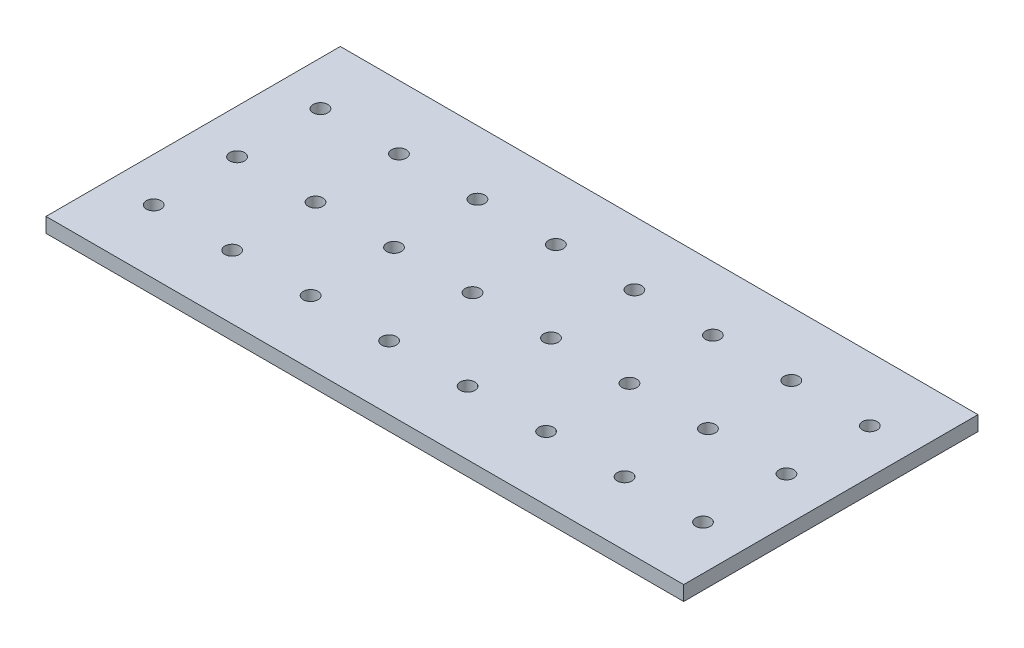
ISO-10303-21;
HEADER;
FILE_DESCRIPTION(('STEP AP214'),'2;1');
FILE_NAME('part.step','',(''),(''),'','','');
FILE_SCHEMA(('AUTOMOTIVE_DESIGN { 1 0 10303 214 1 1 1 1 }'));
ENDSEC;
DATA;
#1=APPLICATION_CONTEXT('core data for automotive mechanical design processes');
#2=APPLICATION_PROTOCOL_DEFINITION('international standard','automotive_design',2000,#1);
#3=PRODUCT_CONTEXT('',#1,'mechanical');
#4=PRODUCT('Part','Part','',(#3));
#5=PRODUCT_RELATED_PRODUCT_CATEGORY('part','',(#4));
#6=PRODUCT_DEFINITION_FORMATION('','',#4);
#7=PRODUCT_DEFINITION_CONTEXT('part definition',#1,'design');
#8=PRODUCT_DEFINITION('design','',#6,#7);
#9=PRODUCT_DEFINITION_SHAPE('','',#8);
#10=(LENGTH_UNIT() NAMED_UNIT(*) SI_UNIT(.MILLI.,.METRE.));
#11=(NAMED_UNIT(*) PLANE_ANGLE_UNIT() SI_UNIT($,.RADIAN.));
#12=(NAMED_UNIT(*) SI_UNIT($,.STERADIAN.) SOLID_ANGLE_UNIT());
#13=UNCERTAINTY_MEASURE_WITH_UNIT(LENGTH_MEASURE(1.E-05),#10,'distance_accuracy_value','');
#14=(GEOMETRIC_REPRESENTATION_CONTEXT(3) GLOBAL_UNCERTAINTY_ASSIGNED_CONTEXT((#13)) GLOBAL_UNIT_ASSIGNED_CONTEXT((#10,
#11,#12)) REPRESENTATION_CONTEXT('',''));
#15=CARTESIAN_POINT('',(0.,0.,0.));
#16=DIRECTION('',(0.,0.,1.));
#17=DIRECTION('',(1.,0.,0.));
#18=AXIS2_PLACEMENT_3D('',#15,#16,#17);
#19=CARTESIAN_POINT('',(65.,3.,-30.));
#20=DIRECTION('',(-1.,0.,0.));
#21=DIRECTION('',(0.,0.,1.));
#22=AXIS2_PLACEMENT_3D('',#19,#20,#21);
#23=PLANE('',#22);
#24=DIRECTION('',(0.,0.,-1.));
#25=VECTOR('',#24,1.);
#26=CARTESIAN_POINT('',(65.,0.,-30.));
#27=LINE('',#26,#25);
#28=CARTESIAN_POINT('',(65.,0.,30.));
#29=VERTEX_POINT('',#28);
#30=CARTESIAN_POINT('',(65.,0.,-30.));
#31=VERTEX_POINT('',#30);
#32=EDGE_CURVE('E106',#29,#31,#27,.T.);
#33=ORIENTED_EDGE('',*,*,#32,.T.);
#34=DIRECTION('',(0.,-1.,0.));
#35=VECTOR('',#34,1.);
#36=CARTESIAN_POINT('',(65.,3.,-30.));
#37=LINE('',#36,#35);
#38=CARTESIAN_POINT('',(65.,3.,-30.));
#39=VERTEX_POINT('',#38);
#40=EDGE_CURVE('E11',#39,#31,#37,.T.);
#41=ORIENTED_EDGE('',*,*,#40,.F.);
#42=DIRECTION('',(0.,0.,-1.));
#43=VECTOR('',#42,1.);
#44=CARTESIAN_POINT('',(65.,3.,-30.));
#45=LINE('',#44,#43);
#46=CARTESIAN_POINT('',(65.,3.,30.));
#47=VERTEX_POINT('',#46);
#48=EDGE_CURVE('E90',#47,#39,#45,.T.);
#49=ORIENTED_EDGE('',*,*,#48,.F.);
#50=DIRECTION('',(0.,-1.,0.));
#51=VECTOR('',#50,1.);
#52=CARTESIAN_POINT('',(65.,3.,30.));
#53=LINE('',#52,#51);
#54=EDGE_CURVE('E102',#47,#29,#53,.T.);
#55=ORIENTED_EDGE('',*,*,#54,.T.);
#56=EDGE_LOOP('',(#33,#41,#49,#55));
#57=FACE_BOUND('',#56,.T.);
#58=ADVANCED_FACE('F38',(#57),#23,.F.);
#59=CARTESIAN_POINT('',(-65.,3.,-30.));
#60=DIRECTION('',(0.,0.,1.));
#61=DIRECTION('',(1.,0.,0.));
#62=AXIS2_PLACEMENT_3D('',#59,#60,#61);
#63=PLANE('',#62);
#64=DIRECTION('',(-1.,0.,0.));
#65=VECTOR('',#64,1.);
#66=CARTESIAN_POINT('',(-65.,0.,-30.));
#67=LINE('',#66,#65);
#68=CARTESIAN_POINT('',(-65.,0.,-30.));
#69=VERTEX_POINT('',#68);
#70=EDGE_CURVE('E95',#31,#69,#67,.T.);
#71=ORIENTED_EDGE('',*,*,#70,.T.);
#72=DIRECTION('',(0.,-1.,0.));
#73=VECTOR('',#72,1.);
#74=CARTESIAN_POINT('',(-65.,3.,-30.));
#75=LINE('',#74,#73);
#76=CARTESIAN_POINT('',(-65.,3.,-30.));
#77=VERTEX_POINT('',#76);
#78=EDGE_CURVE('E47',#77,#69,#75,.T.);
#79=ORIENTED_EDGE('',*,*,#78,.F.);
#80=DIRECTION('',(-1.,0.,0.));
#81=VECTOR('',#80,1.);
#82=CARTESIAN_POINT('',(-65.,3.,-30.));
#83=LINE('',#82,#81);
#84=EDGE_CURVE('E85',#39,#77,#83,.T.);
#85=ORIENTED_EDGE('',*,*,#84,.F.);
#86=ORIENTED_EDGE('',*,*,#40,.T.);
#87=EDGE_LOOP('',(#71,#79,#85,#86));
#88=FACE_BOUND('',#87,.T.);
#89=ADVANCED_FACE('F94',(#88),#63,.F.);
#90=CARTESIAN_POINT('',(-65.,3.,-30.));
#91=DIRECTION('',(1.,0.,0.));
#92=DIRECTION('',(0.,0.,-1.));
#93=AXIS2_PLACEMENT_3D('',#90,#91,#92);
#94=PLANE('',#93);
#95=DIRECTION('',(0.,0.,1.));
#96=VECTOR('',#95,1.);
#97=CARTESIAN_POINT('',(-65.,0.,-30.));
#98=LINE('',#97,#96);
#99=CARTESIAN_POINT('',(-65.,0.,30.));
#100=VERTEX_POINT('',#99);
#101=EDGE_CURVE('E72',#69,#100,#98,.T.);
#102=ORIENTED_EDGE('',*,*,#101,.T.);
#103=DIRECTION('',(0.,-1.,0.));
#104=VECTOR('',#103,1.);
#105=CARTESIAN_POINT('',(-65.,3.,30.));
#106=LINE('',#105,#104);
#107=CARTESIAN_POINT('',(-65.,3.,30.));
#108=VERTEX_POINT('',#107);
#109=EDGE_CURVE('E97',#108,#100,#106,.T.);
#110=ORIENTED_EDGE('',*,*,#109,.F.);
#111=DIRECTION('',(0.,0.,1.));
#112=VECTOR('',#111,1.);
#113=CARTESIAN_POINT('',(-65.,3.,-30.));
#114=LINE('',#113,#112);
#115=EDGE_CURVE('E88',#77,#108,#114,.T.);
#116=ORIENTED_EDGE('',*,*,#115,.F.);
#117=ORIENTED_EDGE('',*,*,#78,.T.);
#118=EDGE_LOOP('',(#102,#110,#116,#117));
#119=FACE_BOUND('',#118,.T.);
#120=ADVANCED_FACE('F98',(#119),#94,.F.);
#121=CARTESIAN_POINT('',(-65.,3.,30.));
#122=DIRECTION('',(0.,0.,-1.));
#123=DIRECTION('',(-1.,0.,0.));
#124=AXIS2_PLACEMENT_3D('',#121,#122,#123);
#125=PLANE('',#124);
#126=DIRECTION('',(1.,0.,0.));
#127=VECTOR('',#126,1.);
#128=CARTESIAN_POINT('',(-65.,0.,30.));
#129=LINE('',#128,#127);
#130=EDGE_CURVE('E78',#100,#29,#129,.T.);
#131=ORIENTED_EDGE('',*,*,#130,.T.);
#132=ORIENTED_EDGE('',*,*,#54,.F.);
#133=DIRECTION('',(1.,0.,0.));
#134=VECTOR('',#133,1.);
#135=CARTESIAN_POINT('',(-65.,3.,30.));
#136=LINE('',#135,#134);
#137=EDGE_CURVE('E55',#108,#47,#136,.T.);
#138=ORIENTED_EDGE('',*,*,#137,.F.);
#139=ORIENTED_EDGE('',*,*,#109,.T.);
#140=EDGE_LOOP('',(#131,#132,#138,#139));
#141=FACE_BOUND('',#140,.T.);
#142=ADVANCED_FACE('F120',(#141),#125,.F.);
#143=CARTESIAN_POINT('',(0.,3.,0.));
#144=DIRECTION('',(0.,1.,0.));
#145=DIRECTION('',(0.,0.,1.));
#146=AXIS2_PLACEMENT_3D('',#143,#144,#145);
#147=PLANE('',#146);
#148=CARTESIAN_POINT('',(-24.0527358685399,3.,0.));
#149=DIRECTION('',(0.,1.,0.));
#150=DIRECTION('',(0.,0.,1.));
#151=AXIS2_PLACEMENT_3D('',#148,#149,#150);
#152=CIRCLE('',#151,1.5);
#153=CARTESIAN_POINT('',(-24.0527358685399,3.,1.5));
#154=VERTEX_POINT('',#153);
#155=EDGE_CURVE('E215',#154,#154,#152,.T.);
#156=ORIENTED_EDGE('',*,*,#155,.F.);
#157=EDGE_LOOP('',(#156));
#158=FACE_BOUND('',#157,.T.);
#159=CARTESIAN_POINT('',(-40.0527358685399,3.,17.));
#160=DIRECTION('',(0.,1.,0.));
#161=DIRECTION('',(0.,0.,1.));
#162=AXIS2_PLACEMENT_3D('',#159,#160,#161);
#163=CIRCLE('',#162,1.5);
#164=CARTESIAN_POINT('',(-40.0527358685399,3.,18.5));
#165=VERTEX_POINT('',#164);
#166=EDGE_CURVE('E224',#165,#165,#163,.T.);
#167=ORIENTED_EDGE('',*,*,#166,.F.);
#168=EDGE_LOOP('',(#167));
#169=FACE_BOUND('',#168,.T.);
#170=CARTESIAN_POINT('',(-40.0527358685399,3.,0.));
#171=DIRECTION('',(0.,1.,0.));
#172=DIRECTION('',(0.,0.,1.));
#173=AXIS2_PLACEMENT_3D('',#170,#171,#172);
#174=CIRCLE('',#173,1.5);
#175=CARTESIAN_POINT('',(-40.0527358685399,3.,1.5));
#176=VERTEX_POINT('',#175);
#177=EDGE_CURVE('E199',#176,#176,#174,.T.);
#178=ORIENTED_EDGE('',*,*,#177,.F.);
#179=EDGE_LOOP('',(#178));
#180=FACE_BOUND('',#179,.T.);
#181=CARTESIAN_POINT('',(-56.0527358685399,3.,17.));
#182=DIRECTION('',(0.,1.,0.));
#183=DIRECTION('',(0.,0.,1.));
#184=AXIS2_PLACEMENT_3D('',#181,#182,#183);
#185=CIRCLE('',#184,1.5);
#186=CARTESIAN_POINT('',(-56.0527358685399,3.,18.5));
#187=VERTEX_POINT('',#186);
#188=EDGE_CURVE('E208',#187,#187,#185,.T.);
#189=ORIENTED_EDGE('',*,*,#188,.F.);
#190=EDGE_LOOP('',(#189));
#191=FACE_BOUND('',#190,.T.);
#192=CARTESIAN_POINT('',(7.9472641314601,3.,0.));
#193=DIRECTION('',(0.,1.,0.));
#194=DIRECTION('',(0.,0.,1.));
#195=AXIS2_PLACEMENT_3D('',#192,#193,#194);
#196=CIRCLE('',#195,1.5);
#197=CARTESIAN_POINT('',(7.9472641314601,3.,1.5));
#198=VERTEX_POINT('',#197);
#199=EDGE_CURVE('E247',#198,#198,#196,.T.);
#200=ORIENTED_EDGE('',*,*,#199,.F.);
#201=EDGE_LOOP('',(#200));
#202=FACE_BOUND('',#201,.T.);
#203=CARTESIAN_POINT('',(-8.0527358685399,3.,17.));
#204=DIRECTION('',(0.,1.,0.));
#205=DIRECTION('',(0.,0.,1.));
#206=AXIS2_PLACEMENT_3D('',#203,#204,#205);
#207=CIRCLE('',#206,1.5);
#208=CARTESIAN_POINT('',(-8.0527358685399,3.,18.5));
#209=VERTEX_POINT('',#208);
#210=EDGE_CURVE('E256',#209,#209,#207,.T.);
#211=ORIENTED_EDGE('',*,*,#210,.F.);
#212=EDGE_LOOP('',(#211));
#213=FACE_BOUND('',#212,.T.);
#214=CARTESIAN_POINT('',(-8.0527358685399,3.,0.));
#215=DIRECTION('',(0.,1.,0.));
#216=DIRECTION('',(0.,0.,1.));
#217=AXIS2_PLACEMENT_3D('',#214,#215,#216);
#218=CIRCLE('',#217,1.5);
#219=CARTESIAN_POINT('',(-8.0527358685399,3.,1.5));
#220=VERTEX_POINT('',#219);
#221=EDGE_CURVE('E231',#220,#220,#218,.T.);
#222=ORIENTED_EDGE('',*,*,#221,.F.);
#223=EDGE_LOOP('',(#222));
#224=FACE_BOUND('',#223,.T.);
#225=CARTESIAN_POINT('',(-24.0527358685399,3.,17.));
#226=DIRECTION('',(0.,1.,0.));
#227=DIRECTION('',(0.,0.,1.));
#228=AXIS2_PLACEMENT_3D('',#225,#226,#227);
#229=CIRCLE('',#228,1.5);
#230=CARTESIAN_POINT('',(-24.0527358685399,3.,18.5));
#231=VERTEX_POINT('',#230);
#232=EDGE_CURVE('E240',#231,#231,#229,.T.);
#233=ORIENTED_EDGE('',*,*,#232,.F.);
#234=EDGE_LOOP('',(#233));
#235=FACE_BOUND('',#234,.T.);
#236=CARTESIAN_POINT('',(-40.0527358685399,3.,-17.));
#237=DIRECTION('',(0.,1.,0.));
#238=DIRECTION('',(0.,0.,1.));
#239=AXIS2_PLACEMENT_3D('',#236,#237,#238);
#240=CIRCLE('',#239,1.5);
#241=CARTESIAN_POINT('',(-40.0527358685399,3.,-15.5));
#242=VERTEX_POINT('',#241);
#243=EDGE_CURVE('E160',#242,#242,#240,.T.);
#244=ORIENTED_EDGE('',*,*,#243,.F.);
#245=EDGE_LOOP('',(#244));
#246=FACE_BOUND('',#245,.T.);
#247=CARTESIAN_POINT('',(-24.0527358685399,3.,-17.));
#248=DIRECTION('',(0.,1.,0.));
#249=DIRECTION('',(0.,0.,1.));
#250=AXIS2_PLACEMENT_3D('',#247,#248,#249);
#251=CIRCLE('',#250,1.5);
#252=CARTESIAN_POINT('',(-24.0527358685399,3.,-15.5));
#253=VERTEX_POINT('',#252);
#254=EDGE_CURVE('E152',#253,#253,#251,.T.);
#255=ORIENTED_EDGE('',*,*,#254,.F.);
#256=EDGE_LOOP('',(#255));
#257=FACE_BOUND('',#256,.T.);
#258=CARTESIAN_POINT('',(-8.0527358685399,3.,-17.));
#259=DIRECTION('',(0.,1.,0.));
#260=DIRECTION('',(0.,0.,1.));
#261=AXIS2_PLACEMENT_3D('',#258,#259,#260);
#262=CIRCLE('',#261,1.5);
#263=CARTESIAN_POINT('',(-8.0527358685399,3.,-15.5));
#264=VERTEX_POINT('',#263);
#265=EDGE_CURVE('E144',#264,#264,#262,.T.);
#266=ORIENTED_EDGE('',*,*,#265,.F.);
#267=EDGE_LOOP('',(#266));
#268=FACE_BOUND('',#267,.T.);
#269=CARTESIAN_POINT('',(7.9472641314601,3.,-17.));
#270=DIRECTION('',(0.,1.,0.));
#271=DIRECTION('',(0.,0.,1.));
#272=AXIS2_PLACEMENT_3D('',#269,#270,#271);
#273=CIRCLE('',#272,1.5);
#274=CARTESIAN_POINT('',(7.9472641314601,3.,-15.5));
#275=VERTEX_POINT('',#274);
#276=EDGE_CURVE('E135',#275,#275,#273,.T.);
#277=ORIENTED_EDGE('',*,*,#276,.F.);
#278=EDGE_LOOP('',(#277));
#279=FACE_BOUND('',#278,.T.);
#280=CARTESIAN_POINT('',(-56.0527358685399,3.,0.));
#281=DIRECTION('',(0.,1.,0.));
#282=DIRECTION('',(0.,0.,1.));
#283=AXIS2_PLACEMENT_3D('',#280,#281,#282);
#284=CIRCLE('',#283,1.5);
#285=CARTESIAN_POINT('',(-56.0527358685399,3.,1.5));
#286=VERTEX_POINT('',#285);
#287=EDGE_CURVE('E183',#286,#286,#284,.T.);
#288=ORIENTED_EDGE('',*,*,#287,.F.);
#289=EDGE_LOOP('',(#288));
#290=FACE_BOUND('',#289,.T.);
#291=CARTESIAN_POINT('',(55.9472641314601,3.,-17.));
#292=DIRECTION('',(0.,1.,0.));
#293=DIRECTION('',(0.,0.,1.));
#294=AXIS2_PLACEMENT_3D('',#291,#292,#293);
#295=CIRCLE('',#294,1.5);
#296=CARTESIAN_POINT('',(55.9472641314601,3.,-15.5));
#297=VERTEX_POINT('',#296);
#298=EDGE_CURVE('E192',#297,#297,#295,.T.);
#299=ORIENTED_EDGE('',*,*,#298,.F.);
#300=EDGE_LOOP('',(#299));
#301=FACE_BOUND('',#300,.T.);
#302=CARTESIAN_POINT('',(39.9472641314601,3.,-17.));
#303=DIRECTION('',(0.,1.,0.));
#304=DIRECTION('',(0.,0.,1.));
#305=AXIS2_PLACEMENT_3D('',#302,#303,#304);
#306=CIRCLE('',#305,1.5);
#307=CARTESIAN_POINT('',(39.9472641314601,3.,-15.5));
#308=VERTEX_POINT('',#307);
#309=EDGE_CURVE('E167',#308,#308,#306,.T.);
#310=ORIENTED_EDGE('',*,*,#309,.F.);
#311=EDGE_LOOP('',(#310));
#312=FACE_BOUND('',#311,.T.);
#313=CARTESIAN_POINT('',(23.9472641314601,3.,-17.));
#314=DIRECTION('',(0.,1.,0.));
#315=DIRECTION('',(0.,0.,1.));
#316=AXIS2_PLACEMENT_3D('',#313,#314,#315);
#317=CIRCLE('',#316,1.5);
#318=CARTESIAN_POINT('',(23.9472641314601,3.,-15.5));
#319=VERTEX_POINT('',#318);
#320=EDGE_CURVE('E176',#319,#319,#317,.T.);
#321=ORIENTED_EDGE('',*,*,#320,.F.);
#322=EDGE_LOOP('',(#321));
#323=FACE_BOUND('',#322,.T.);
#324=CARTESIAN_POINT('',(39.9472641314601,3.,17.));
#325=DIRECTION('',(0.,1.,0.));
#326=DIRECTION('',(0.,0.,1.));
#327=AXIS2_PLACEMENT_3D('',#324,#325,#326);
#328=CIRCLE('',#327,1.5);
#329=CARTESIAN_POINT('',(39.9472641314601,3.,18.5));
#330=VERTEX_POINT('',#329);
#331=EDGE_CURVE('E304',#330,#330,#328,.T.);
#332=ORIENTED_EDGE('',*,*,#331,.F.);
#333=EDGE_LOOP('',(#332));
#334=FACE_BOUND('',#333,.T.);
#335=CARTESIAN_POINT('',(55.9472641314601,3.,0.));
#336=DIRECTION('',(0.,1.,0.));
#337=DIRECTION('',(0.,0.,1.));
#338=AXIS2_PLACEMENT_3D('',#335,#336,#337);
#339=CIRCLE('',#338,1.5);
#340=CARTESIAN_POINT('',(55.9472641314601,3.,1.5));
#341=VERTEX_POINT('',#340);
#342=EDGE_CURVE('E295',#341,#341,#339,.T.);
#343=ORIENTED_EDGE('',*,*,#342,.F.);
#344=EDGE_LOOP('',(#343));
#345=FACE_BOUND('',#344,.T.);
#346=CARTESIAN_POINT('',(55.9472641314601,3.,17.));
#347=DIRECTION('',(0.,1.,0.));
#348=DIRECTION('',(0.,0.,1.));
#349=AXIS2_PLACEMENT_3D('',#346,#347,#348);
#350=CIRCLE('',#349,1.5);
#351=CARTESIAN_POINT('',(55.9472641314601,3.,18.5));
#352=VERTEX_POINT('',#351);
#353=EDGE_CURVE('E311',#352,#352,#350,.T.);
#354=ORIENTED_EDGE('',*,*,#353,.F.);
#355=EDGE_LOOP('',(#354));
#356=FACE_BOUND('',#355,.T.);
#357=CARTESIAN_POINT('',(7.9472641314601,3.,17.));
#358=DIRECTION('',(0.,1.,0.));
#359=DIRECTION('',(0.,0.,1.));
#360=AXIS2_PLACEMENT_3D('',#357,#358,#359);
#361=CIRCLE('',#360,1.5);
#362=CARTESIAN_POINT('',(7.9472641314601,3.,18.5));
#363=VERTEX_POINT('',#362);
#364=EDGE_CURVE('E272',#363,#363,#361,.T.);
#365=ORIENTED_EDGE('',*,*,#364,.F.);
#366=EDGE_LOOP('',(#365));
#367=FACE_BOUND('',#366,.T.);
#368=CARTESIAN_POINT('',(23.9472641314601,3.,0.));
#369=DIRECTION('',(0.,1.,0.));
#370=DIRECTION('',(0.,0.,1.));
#371=AXIS2_PLACEMENT_3D('',#368,#369,#370);
#372=CIRCLE('',#371,1.5);
#373=CARTESIAN_POINT('',(23.9472641314601,3.,1.5));
#374=VERTEX_POINT('',#373);
#375=EDGE_CURVE('E263',#374,#374,#372,.T.);
#376=ORIENTED_EDGE('',*,*,#375,.F.);
#377=EDGE_LOOP('',(#376));
#378=FACE_BOUND('',#377,.T.);
#379=CARTESIAN_POINT('',(23.9472641314601,3.,17.));
#380=DIRECTION('',(0.,1.,0.));
#381=DIRECTION('',(0.,0.,1.));
#382=AXIS2_PLACEMENT_3D('',#379,#380,#381);
#383=CIRCLE('',#382,1.5);
#384=CARTESIAN_POINT('',(23.9472641314601,3.,18.5));
#385=VERTEX_POINT('',#384);
#386=EDGE_CURVE('E288',#385,#385,#383,.T.);
#387=ORIENTED_EDGE('',*,*,#386,.F.);
#388=EDGE_LOOP('',(#387));
#389=FACE_BOUND('',#388,.T.);
#390=CARTESIAN_POINT('',(39.9472641314601,3.,0.));
#391=DIRECTION('',(0.,1.,0.));
#392=DIRECTION('',(0.,0.,1.));
#393=AXIS2_PLACEMENT_3D('',#390,#391,#392);
#394=CIRCLE('',#393,1.5);
#395=CARTESIAN_POINT('',(39.9472641314601,3.,1.5));
#396=VERTEX_POINT('',#395);
#397=EDGE_CURVE('E279',#396,#396,#394,.T.);
#398=ORIENTED_EDGE('',*,*,#397,.F.);
#399=EDGE_LOOP('',(#398));
#400=FACE_BOUND('',#399,.T.);
#401=CARTESIAN_POINT('',(-56.0527358685399,3.,-17.));
#402=DIRECTION('',(0.,1.,0.));
#403=DIRECTION('',(0.,0.,1.));
#404=AXIS2_PLACEMENT_3D('',#401,#402,#403);
#405=CIRCLE('',#404,1.5);
#406=CARTESIAN_POINT('',(-56.0527358685399,3.,-15.5));
#407=VERTEX_POINT('',#406);
#408=EDGE_CURVE('E127',#407,#407,#405,.T.);
#409=ORIENTED_EDGE('',*,*,#408,.F.);
#410=EDGE_LOOP('',(#409));
#411=FACE_BOUND('',#410,.T.);
#412=ORIENTED_EDGE('',*,*,#48,.T.);
#413=ORIENTED_EDGE('',*,*,#84,.T.);
#414=ORIENTED_EDGE('',*,*,#115,.T.);
#415=ORIENTED_EDGE('',*,*,#137,.T.);
#416=EDGE_LOOP('',(#412,#413,#414,#415));
#417=FACE_BOUND('',#416,.T.);
#418=ADVANCED_FACE('F86',(#158,#169,#180,#191,#202,#213,#224,#235,#246,#257,#268,#279,#290,#301,
#312,#323,#334,#345,#356,#367,#378,#389,#400,#411,#417),#147,.T.);
#419=CARTESIAN_POINT('',(0.,0.,0.));
#420=DIRECTION('',(0.,1.,0.));
#421=DIRECTION('',(0.,0.,1.));
#422=AXIS2_PLACEMENT_3D('',#419,#420,#421);
#423=PLANE('',#422);
#424=CARTESIAN_POINT('',(-24.0527358685399,0.,0.));
#425=DIRECTION('',(0.,1.,0.));
#426=DIRECTION('',(0.,0.,1.));
#427=AXIS2_PLACEMENT_3D('',#424,#425,#426);
#428=CIRCLE('',#427,1.5);
#429=CARTESIAN_POINT('',(-24.0527358685399,0.,1.5));
#430=VERTEX_POINT('',#429);
#431=EDGE_CURVE('E219',#430,#430,#428,.T.);
#432=ORIENTED_EDGE('',*,*,#431,.T.);
#433=EDGE_LOOP('',(#432));
#434=FACE_BOUND('',#433,.T.);
#435=CARTESIAN_POINT('',(-40.0527358685399,0.,17.));
#436=DIRECTION('',(0.,1.,0.));
#437=DIRECTION('',(0.,0.,1.));
#438=AXIS2_PLACEMENT_3D('',#435,#436,#437);
#439=CIRCLE('',#438,1.5);
#440=CARTESIAN_POINT('',(-40.0527358685399,0.,18.5));
#441=VERTEX_POINT('',#440);
#442=EDGE_CURVE('E204',#441,#441,#439,.T.);
#443=ORIENTED_EDGE('',*,*,#442,.T.);
#444=EDGE_LOOP('',(#443));
#445=FACE_BOUND('',#444,.T.);
#446=CARTESIAN_POINT('',(-40.0527358685399,0.,0.));
#447=DIRECTION('',(0.,1.,0.));
#448=DIRECTION('',(0.,0.,1.));
#449=AXIS2_PLACEMENT_3D('',#446,#447,#448);
#450=CIRCLE('',#449,1.5);
#451=CARTESIAN_POINT('',(-40.0527358685399,0.,1.5));
#452=VERTEX_POINT('',#451);
#453=EDGE_CURVE('E203',#452,#452,#450,.T.);
#454=ORIENTED_EDGE('',*,*,#453,.T.);
#455=EDGE_LOOP('',(#454));
#456=FACE_BOUND('',#455,.T.);
#457=CARTESIAN_POINT('',(-56.0527358685399,0.,17.));
#458=DIRECTION('',(0.,1.,0.));
#459=DIRECTION('',(0.,0.,1.));
#460=AXIS2_PLACEMENT_3D('',#457,#458,#459);
#461=CIRCLE('',#460,1.5);
#462=CARTESIAN_POINT('',(-56.0527358685399,0.,18.5));
#463=VERTEX_POINT('',#462);
#464=EDGE_CURVE('E188',#463,#463,#461,.T.);
#465=ORIENTED_EDGE('',*,*,#464,.T.);
#466=EDGE_LOOP('',(#465));
#467=FACE_BOUND('',#466,.T.);
#468=CARTESIAN_POINT('',(7.9472641314601,0.,0.));
#469=DIRECTION('',(0.,1.,0.));
#470=DIRECTION('',(0.,0.,1.));
#471=AXIS2_PLACEMENT_3D('',#468,#469,#470);
#472=CIRCLE('',#471,1.5);
#473=CARTESIAN_POINT('',(7.9472641314601,0.,1.5));
#474=VERTEX_POINT('',#473);
#475=EDGE_CURVE('E251',#474,#474,#472,.T.);
#476=ORIENTED_EDGE('',*,*,#475,.T.);
#477=EDGE_LOOP('',(#476));
#478=FACE_BOUND('',#477,.T.);
#479=CARTESIAN_POINT('',(-8.0527358685399,0.,17.));
#480=DIRECTION('',(0.,1.,0.));
#481=DIRECTION('',(0.,0.,1.));
#482=AXIS2_PLACEMENT_3D('',#479,#480,#481);
#483=CIRCLE('',#482,1.5);
#484=CARTESIAN_POINT('',(-8.0527358685399,0.,18.5));
#485=VERTEX_POINT('',#484);
#486=EDGE_CURVE('E236',#485,#485,#483,.T.);
#487=ORIENTED_EDGE('',*,*,#486,.T.);
#488=EDGE_LOOP('',(#487));
#489=FACE_BOUND('',#488,.T.);
#490=CARTESIAN_POINT('',(-8.0527358685399,0.,0.));
#491=DIRECTION('',(0.,1.,0.));
#492=DIRECTION('',(0.,0.,1.));
#493=AXIS2_PLACEMENT_3D('',#490,#491,#492);
#494=CIRCLE('',#493,1.5);
#495=CARTESIAN_POINT('',(-8.0527358685399,0.,1.5));
#496=VERTEX_POINT('',#495);
#497=EDGE_CURVE('E235',#496,#496,#494,.T.);
#498=ORIENTED_EDGE('',*,*,#497,.T.);
#499=EDGE_LOOP('',(#498));
#500=FACE_BOUND('',#499,.T.);
#501=CARTESIAN_POINT('',(-24.0527358685399,0.,17.));
#502=DIRECTION('',(0.,1.,0.));
#503=DIRECTION('',(0.,0.,1.));
#504=AXIS2_PLACEMENT_3D('',#501,#502,#503);
#505=CIRCLE('',#504,1.5);
#506=CARTESIAN_POINT('',(-24.0527358685399,0.,18.5));
#507=VERTEX_POINT('',#506);
#508=EDGE_CURVE('E220',#507,#507,#505,.T.);
#509=ORIENTED_EDGE('',*,*,#508,.T.);
#510=EDGE_LOOP('',(#509));
#511=FACE_BOUND('',#510,.T.);
#512=CARTESIAN_POINT('',(-40.0527358685399,0.,-17.));
#513=DIRECTION('',(0.,1.,0.));
#514=DIRECTION('',(0.,0.,1.));
#515=AXIS2_PLACEMENT_3D('',#512,#513,#514);
#516=CIRCLE('',#515,1.5);
#517=CARTESIAN_POINT('',(-40.0527358685399,0.,-15.5));
#518=VERTEX_POINT('',#517);
#519=EDGE_CURVE('E131',#518,#518,#516,.T.);
#520=ORIENTED_EDGE('',*,*,#519,.T.);
#521=EDGE_LOOP('',(#520));
#522=FACE_BOUND('',#521,.T.);
#523=CARTESIAN_POINT('',(-24.0527358685399,0.,-17.));
#524=DIRECTION('',(0.,1.,0.));
#525=DIRECTION('',(0.,0.,1.));
#526=AXIS2_PLACEMENT_3D('',#523,#524,#525);
#527=CIRCLE('',#526,1.5);
#528=CARTESIAN_POINT('',(-24.0527358685399,0.,-15.5));
#529=VERTEX_POINT('',#528);
#530=EDGE_CURVE('E156',#529,#529,#527,.T.);
#531=ORIENTED_EDGE('',*,*,#530,.T.);
#532=EDGE_LOOP('',(#531));
#533=FACE_BOUND('',#532,.T.);
#534=CARTESIAN_POINT('',(-8.0527358685399,0.,-17.));
#535=DIRECTION('',(0.,1.,0.));
#536=DIRECTION('',(0.,0.,1.));
#537=AXIS2_PLACEMENT_3D('',#534,#535,#536);
#538=CIRCLE('',#537,1.5);
#539=CARTESIAN_POINT('',(-8.0527358685399,0.,-15.5));
#540=VERTEX_POINT('',#539);
#541=EDGE_CURVE('E148',#540,#540,#538,.T.);
#542=ORIENTED_EDGE('',*,*,#541,.T.);
#543=EDGE_LOOP('',(#542));
#544=FACE_BOUND('',#543,.T.);
#545=CARTESIAN_POINT('',(7.9472641314601,0.,-17.));
#546=DIRECTION('',(0.,1.,0.));
#547=DIRECTION('',(0.,0.,1.));
#548=AXIS2_PLACEMENT_3D('',#545,#546,#547);
#549=CIRCLE('',#548,1.5);
#550=CARTESIAN_POINT('',(7.9472641314601,0.,-15.5));
#551=VERTEX_POINT('',#550);
#552=EDGE_CURVE('E139',#551,#551,#549,.T.);
#553=ORIENTED_EDGE('',*,*,#552,.T.);
#554=EDGE_LOOP('',(#553));
#555=FACE_BOUND('',#554,.T.);
#556=CARTESIAN_POINT('',(-56.0527358685399,0.,0.));
#557=DIRECTION('',(0.,1.,0.));
#558=DIRECTION('',(0.,0.,1.));
#559=AXIS2_PLACEMENT_3D('',#556,#557,#558);
#560=CIRCLE('',#559,1.5);
#561=CARTESIAN_POINT('',(-56.0527358685399,0.,1.5));
#562=VERTEX_POINT('',#561);
#563=EDGE_CURVE('E187',#562,#562,#560,.T.);
#564=ORIENTED_EDGE('',*,*,#563,.T.);
#565=EDGE_LOOP('',(#564));
#566=FACE_BOUND('',#565,.T.);
#567=CARTESIAN_POINT('',(55.9472641314601,0.,-17.));
#568=DIRECTION('',(0.,1.,0.));
#569=DIRECTION('',(0.,0.,1.));
#570=AXIS2_PLACEMENT_3D('',#567,#568,#569);
#571=CIRCLE('',#570,1.5);
#572=CARTESIAN_POINT('',(55.9472641314601,0.,-15.5));
#573=VERTEX_POINT('',#572);
#574=EDGE_CURVE('E172',#573,#573,#571,.T.);
#575=ORIENTED_EDGE('',*,*,#574,.T.);
#576=EDGE_LOOP('',(#575));
#577=FACE_BOUND('',#576,.T.);
#578=CARTESIAN_POINT('',(39.9472641314601,0.,-17.));
#579=DIRECTION('',(0.,1.,0.));
#580=DIRECTION('',(0.,0.,1.));
#581=AXIS2_PLACEMENT_3D('',#578,#579,#580);
#582=CIRCLE('',#581,1.5);
#583=CARTESIAN_POINT('',(39.9472641314601,0.,-15.5));
#584=VERTEX_POINT('',#583);
#585=EDGE_CURVE('E171',#584,#584,#582,.T.);
#586=ORIENTED_EDGE('',*,*,#585,.T.);
#587=EDGE_LOOP('',(#586));
#588=FACE_BOUND('',#587,.T.);
#589=CARTESIAN_POINT('',(23.9472641314601,0.,-17.));
#590=DIRECTION('',(0.,1.,0.));
#591=DIRECTION('',(0.,0.,1.));
#592=AXIS2_PLACEMENT_3D('',#589,#590,#591);
#593=CIRCLE('',#592,1.5);
#594=CARTESIAN_POINT('',(23.9472641314601,0.,-15.5));
#595=VERTEX_POINT('',#594);
#596=EDGE_CURVE('E140',#595,#595,#593,.T.);
#597=ORIENTED_EDGE('',*,*,#596,.T.);
#598=EDGE_LOOP('',(#597));
#599=FACE_BOUND('',#598,.T.);
#600=CARTESIAN_POINT('',(39.9472641314601,0.,17.));
#601=DIRECTION('',(0.,1.,0.));
#602=DIRECTION('',(0.,0.,1.));
#603=AXIS2_PLACEMENT_3D('',#600,#601,#602);
#604=CIRCLE('',#603,1.5);
#605=CARTESIAN_POINT('',(39.9472641314601,0.,18.5));
#606=VERTEX_POINT('',#605);
#607=EDGE_CURVE('E284',#606,#606,#604,.T.);
#608=ORIENTED_EDGE('',*,*,#607,.T.);
#609=EDGE_LOOP('',(#608));
#610=FACE_BOUND('',#609,.T.);
#611=CARTESIAN_POINT('',(55.9472641314601,0.,0.));
#612=DIRECTION('',(0.,1.,0.));
#613=DIRECTION('',(0.,0.,1.));
#614=AXIS2_PLACEMENT_3D('',#611,#612,#613);
#615=CIRCLE('',#614,1.5);
#616=CARTESIAN_POINT('',(55.9472641314601,0.,1.5));
#617=VERTEX_POINT('',#616);
#618=EDGE_CURVE('E299',#617,#617,#615,.T.);
#619=ORIENTED_EDGE('',*,*,#618,.T.);
#620=EDGE_LOOP('',(#619));
#621=FACE_BOUND('',#620,.T.);
#622=CARTESIAN_POINT('',(55.9472641314601,0.,17.));
#623=DIRECTION('',(0.,1.,0.));
#624=DIRECTION('',(0.,0.,1.));
#625=AXIS2_PLACEMENT_3D('',#622,#623,#624);
#626=CIRCLE('',#625,1.5);
#627=CARTESIAN_POINT('',(55.9472641314601,0.,18.5));
#628=VERTEX_POINT('',#627);
#629=EDGE_CURVE('E300',#628,#628,#626,.T.);
#630=ORIENTED_EDGE('',*,*,#629,.T.);
#631=EDGE_LOOP('',(#630));
#632=FACE_BOUND('',#631,.T.);
#633=CARTESIAN_POINT('',(7.9472641314601,0.,17.));
#634=DIRECTION('',(0.,1.,0.));
#635=DIRECTION('',(0.,0.,1.));
#636=AXIS2_PLACEMENT_3D('',#633,#634,#635);
#637=CIRCLE('',#636,1.5);
#638=CARTESIAN_POINT('',(7.9472641314601,0.,18.5));
#639=VERTEX_POINT('',#638);
#640=EDGE_CURVE('E252',#639,#639,#637,.T.);
#641=ORIENTED_EDGE('',*,*,#640,.T.);
#642=EDGE_LOOP('',(#641));
#643=FACE_BOUND('',#642,.T.);
#644=CARTESIAN_POINT('',(23.9472641314601,0.,0.));
#645=DIRECTION('',(0.,1.,0.));
#646=DIRECTION('',(0.,0.,1.));
#647=AXIS2_PLACEMENT_3D('',#644,#645,#646);
#648=CIRCLE('',#647,1.5);
#649=CARTESIAN_POINT('',(23.9472641314601,0.,1.5));
#650=VERTEX_POINT('',#649);
#651=EDGE_CURVE('E267',#650,#650,#648,.T.);
#652=ORIENTED_EDGE('',*,*,#651,.T.);
#653=EDGE_LOOP('',(#652));
#654=FACE_BOUND('',#653,.T.);
#655=CARTESIAN_POINT('',(23.9472641314601,0.,17.));
#656=DIRECTION('',(0.,1.,0.));
#657=DIRECTION('',(0.,0.,1.));
#658=AXIS2_PLACEMENT_3D('',#655,#656,#657);
#659=CIRCLE('',#658,1.5);
#660=CARTESIAN_POINT('',(23.9472641314601,0.,18.5));
#661=VERTEX_POINT('',#660);
#662=EDGE_CURVE('E268',#661,#661,#659,.T.);
#663=ORIENTED_EDGE('',*,*,#662,.T.);
#664=EDGE_LOOP('',(#663));
#665=FACE_BOUND('',#664,.T.);
#666=CARTESIAN_POINT('',(39.9472641314601,0.,0.));
#667=DIRECTION('',(0.,1.,0.));
#668=DIRECTION('',(0.,0.,1.));
#669=AXIS2_PLACEMENT_3D('',#666,#667,#668);
#670=CIRCLE('',#669,1.5);
#671=CARTESIAN_POINT('',(39.9472641314601,0.,1.5));
#672=VERTEX_POINT('',#671);
#673=EDGE_CURVE('E283',#672,#672,#670,.T.);
#674=ORIENTED_EDGE('',*,*,#673,.T.);
#675=EDGE_LOOP('',(#674));
#676=FACE_BOUND('',#675,.T.);
#677=CARTESIAN_POINT('',(-56.0527358685399,0.,-17.));
#678=DIRECTION('',(0.,1.,0.));
#679=DIRECTION('',(0.,0.,1.));
#680=AXIS2_PLACEMENT_3D('',#677,#678,#679);
#681=CIRCLE('',#680,1.5);
#682=CARTESIAN_POINT('',(-56.0527358685399,0.,-15.5));
#683=VERTEX_POINT('',#682);
#684=EDGE_CURVE('E110',#683,#683,#681,.T.);
#685=ORIENTED_EDGE('',*,*,#684,.T.);
#686=EDGE_LOOP('',(#685));
#687=FACE_BOUND('',#686,.T.);
#688=ORIENTED_EDGE('',*,*,#32,.F.);
#689=ORIENTED_EDGE('',*,*,#130,.F.);
#690=ORIENTED_EDGE('',*,*,#101,.F.);
#691=ORIENTED_EDGE('',*,*,#70,.F.);
#692=EDGE_LOOP('',(#688,#689,#690,#691));
#693=FACE_BOUND('',#692,.T.);
#694=ADVANCED_FACE('F123',(#434,#445,#456,#467,#478,#489,#500,#511,#522,#533,#544,#555,#566,
#577,#588,#599,#610,#621,#632,#643,#654,#665,#676,#687,#693),#423,.F.);
#695=CARTESIAN_POINT('',(-56.0527358685399,0.,-17.));
#696=DIRECTION('',(0.,1.,0.));
#697=DIRECTION('',(0.,0.,1.));
#698=AXIS2_PLACEMENT_3D('',#695,#696,#697);
#699=CYLINDRICAL_SURFACE('',#698,1.5);
#700=ORIENTED_EDGE('',*,*,#684,.F.);
#701=EDGE_LOOP('',(#700));
#702=FACE_BOUND('',#701,.T.);
#703=ORIENTED_EDGE('',*,*,#408,.T.);
#704=EDGE_LOOP('',(#703));
#705=FACE_BOUND('',#704,.T.);
#706=ADVANCED_FACE('F343',(#702,#705),#699,.F.);
#707=CARTESIAN_POINT('',(39.9472641314601,0.,0.));
#708=DIRECTION('',(0.,1.,0.));
#709=DIRECTION('',(0.,0.,1.));
#710=AXIS2_PLACEMENT_3D('',#707,#708,#709);
#711=CYLINDRICAL_SURFACE('',#710,1.5);
#712=ORIENTED_EDGE('',*,*,#673,.F.);
#713=EDGE_LOOP('',(#712));
#714=FACE_BOUND('',#713,.T.);
#715=ORIENTED_EDGE('',*,*,#397,.T.);
#716=EDGE_LOOP('',(#715));
#717=FACE_BOUND('',#716,.T.);
#718=ADVANCED_FACE('F345',(#714,#717),#711,.F.);
#719=CARTESIAN_POINT('',(23.9472641314601,0.,17.));
#720=DIRECTION('',(0.,1.,0.));
#721=DIRECTION('',(0.,0.,1.));
#722=AXIS2_PLACEMENT_3D('',#719,#720,#721);
#723=CYLINDRICAL_SURFACE('',#722,1.5);
#724=ORIENTED_EDGE('',*,*,#662,.F.);
#725=EDGE_LOOP('',(#724));
#726=FACE_BOUND('',#725,.T.);
#727=ORIENTED_EDGE('',*,*,#386,.T.);
#728=EDGE_LOOP('',(#727));
#729=FACE_BOUND('',#728,.T.);
#730=ADVANCED_FACE('F352',(#726,#729),#723,.F.);
#731=CARTESIAN_POINT('',(23.9472641314601,0.,0.));
#732=DIRECTION('',(0.,1.,0.));
#733=DIRECTION('',(0.,0.,1.));
#734=AXIS2_PLACEMENT_3D('',#731,#732,#733);
#735=CYLINDRICAL_SURFACE('',#734,1.5);
#736=ORIENTED_EDGE('',*,*,#651,.F.);
#737=EDGE_LOOP('',(#736));
#738=FACE_BOUND('',#737,.T.);
#739=ORIENTED_EDGE('',*,*,#375,.T.);
#740=EDGE_LOOP('',(#739));
#741=FACE_BOUND('',#740,.T.);
#742=ADVANCED_FACE('F400',(#738,#741),#735,.F.);
#743=CARTESIAN_POINT('',(7.9472641314601,0.,17.));
#744=DIRECTION('',(0.,1.,0.));
#745=DIRECTION('',(0.,0.,1.));
#746=AXIS2_PLACEMENT_3D('',#743,#744,#745);
#747=CYLINDRICAL_SURFACE('',#746,1.5);
#748=ORIENTED_EDGE('',*,*,#640,.F.);
#749=EDGE_LOOP('',(#748));
#750=FACE_BOUND('',#749,.T.);
#751=ORIENTED_EDGE('',*,*,#364,.T.);
#752=EDGE_LOOP('',(#751));
#753=FACE_BOUND('',#752,.T.);
#754=ADVANCED_FACE('F325',(#750,#753),#747,.F.);
#755=CARTESIAN_POINT('',(55.9472641314601,0.,17.));
#756=DIRECTION('',(0.,1.,0.));
#757=DIRECTION('',(0.,0.,1.));
#758=AXIS2_PLACEMENT_3D('',#755,#756,#757);
#759=CYLINDRICAL_SURFACE('',#758,1.5);
#760=ORIENTED_EDGE('',*,*,#629,.F.);
#761=EDGE_LOOP('',(#760));
#762=FACE_BOUND('',#761,.T.);
#763=ORIENTED_EDGE('',*,*,#353,.T.);
#764=EDGE_LOOP('',(#763));
#765=FACE_BOUND('',#764,.T.);
#766=ADVANCED_FACE('F321',(#762,#765),#759,.F.);
#767=CARTESIAN_POINT('',(55.9472641314601,0.,0.));
#768=DIRECTION('',(0.,1.,0.));
#769=DIRECTION('',(0.,0.,1.));
#770=AXIS2_PLACEMENT_3D('',#767,#768,#769);
#771=CYLINDRICAL_SURFACE('',#770,1.5);
#772=ORIENTED_EDGE('',*,*,#618,.F.);
#773=EDGE_LOOP('',(#772));
#774=FACE_BOUND('',#773,.T.);
#775=ORIENTED_EDGE('',*,*,#342,.T.);
#776=EDGE_LOOP('',(#775));
#777=FACE_BOUND('',#776,.T.);
#778=ADVANCED_FACE('F324',(#774,#777),#771,.F.);
#779=CARTESIAN_POINT('',(39.9472641314601,0.,17.));
#780=DIRECTION('',(0.,1.,0.));
#781=DIRECTION('',(0.,0.,1.));
#782=AXIS2_PLACEMENT_3D('',#779,#780,#781);
#783=CYLINDRICAL_SURFACE('',#782,1.5);
#784=ORIENTED_EDGE('',*,*,#607,.F.);
#785=EDGE_LOOP('',(#784));
#786=FACE_BOUND('',#785,.T.);
#787=ORIENTED_EDGE('',*,*,#331,.T.);
#788=EDGE_LOOP('',(#787));
#789=FACE_BOUND('',#788,.T.);
#790=ADVANCED_FACE('F434',(#786,#789),#783,.F.);
#791=CARTESIAN_POINT('',(23.9472641314601,0.,-17.));
#792=DIRECTION('',(0.,1.,0.));
#793=DIRECTION('',(0.,0.,1.));
#794=AXIS2_PLACEMENT_3D('',#791,#792,#793);
#795=CYLINDRICAL_SURFACE('',#794,1.5);
#796=ORIENTED_EDGE('',*,*,#596,.F.);
#797=EDGE_LOOP('',(#796));
#798=FACE_BOUND('',#797,.T.);
#799=ORIENTED_EDGE('',*,*,#320,.T.);
#800=EDGE_LOOP('',(#799));
#801=FACE_BOUND('',#800,.T.);
#802=ADVANCED_FACE('F444',(#798,#801),#795,.F.);
#803=CARTESIAN_POINT('',(39.9472641314601,0.,-17.));
#804=DIRECTION('',(0.,1.,0.));
#805=DIRECTION('',(0.,0.,1.));
#806=AXIS2_PLACEMENT_3D('',#803,#804,#805);
#807=CYLINDRICAL_SURFACE('',#806,1.5);
#808=ORIENTED_EDGE('',*,*,#585,.F.);
#809=EDGE_LOOP('',(#808));
#810=FACE_BOUND('',#809,.T.);
#811=ORIENTED_EDGE('',*,*,#309,.T.);
#812=EDGE_LOOP('',(#811));
#813=FACE_BOUND('',#812,.T.);
#814=ADVANCED_FACE('F454',(#810,#813),#807,.F.);
#815=CARTESIAN_POINT('',(55.9472641314601,0.,-17.));
#816=DIRECTION('',(0.,1.,0.));
#817=DIRECTION('',(0.,0.,1.));
#818=AXIS2_PLACEMENT_3D('',#815,#816,#817);
#819=CYLINDRICAL_SURFACE('',#818,1.5);
#820=ORIENTED_EDGE('',*,*,#574,.F.);
#821=EDGE_LOOP('',(#820));
#822=FACE_BOUND('',#821,.T.);
#823=ORIENTED_EDGE('',*,*,#298,.T.);
#824=EDGE_LOOP('',(#823));
#825=FACE_BOUND('',#824,.T.);
#826=ADVANCED_FACE('F464',(#822,#825),#819,.F.);
#827=CARTESIAN_POINT('',(-56.0527358685399,0.,0.));
#828=DIRECTION('',(0.,1.,0.));
#829=DIRECTION('',(0.,0.,1.));
#830=AXIS2_PLACEMENT_3D('',#827,#828,#829);
#831=CYLINDRICAL_SURFACE('',#830,1.5);
#832=ORIENTED_EDGE('',*,*,#563,.F.);
#833=EDGE_LOOP('',(#832));
#834=FACE_BOUND('',#833,.T.);
#835=ORIENTED_EDGE('',*,*,#287,.T.);
#836=EDGE_LOOP('',(#835));
#837=FACE_BOUND('',#836,.T.);
#838=ADVANCED_FACE('F474',(#834,#837),#831,.F.);
#839=CARTESIAN_POINT('',(7.9472641314601,0.,-17.));
#840=DIRECTION('',(0.,1.,0.));
#841=DIRECTION('',(0.,0.,1.));
#842=AXIS2_PLACEMENT_3D('',#839,#840,#841);
#843=CYLINDRICAL_SURFACE('',#842,1.5);
#844=ORIENTED_EDGE('',*,*,#552,.F.);
#845=EDGE_LOOP('',(#844));
#846=FACE_BOUND('',#845,.T.);
#847=ORIENTED_EDGE('',*,*,#276,.T.);
#848=EDGE_LOOP('',(#847));
#849=FACE_BOUND('',#848,.T.);
#850=ADVANCED_FACE('F484',(#846,#849),#843,.F.);
#851=CARTESIAN_POINT('',(-8.0527358685399,0.,-17.));
#852=DIRECTION('',(0.,1.,0.));
#853=DIRECTION('',(0.,0.,1.));
#854=AXIS2_PLACEMENT_3D('',#851,#852,#853);
#855=CYLINDRICAL_SURFACE('',#854,1.5);
#856=ORIENTED_EDGE('',*,*,#541,.F.);
#857=EDGE_LOOP('',(#856));
#858=FACE_BOUND('',#857,.T.);
#859=ORIENTED_EDGE('',*,*,#265,.T.);
#860=EDGE_LOOP('',(#859));
#861=FACE_BOUND('',#860,.T.);
#862=ADVANCED_FACE('F494',(#858,#861),#855,.F.);
#863=CARTESIAN_POINT('',(-24.0527358685399,0.,-17.));
#864=DIRECTION('',(0.,1.,0.));
#865=DIRECTION('',(0.,0.,1.));
#866=AXIS2_PLACEMENT_3D('',#863,#864,#865);
#867=CYLINDRICAL_SURFACE('',#866,1.5);
#868=ORIENTED_EDGE('',*,*,#530,.F.);
#869=EDGE_LOOP('',(#868));
#870=FACE_BOUND('',#869,.T.);
#871=ORIENTED_EDGE('',*,*,#254,.T.);
#872=EDGE_LOOP('',(#871));
#873=FACE_BOUND('',#872,.T.);
#874=ADVANCED_FACE('F503',(#870,#873),#867,.F.);
#875=CARTESIAN_POINT('',(-40.0527358685399,0.,-17.));
#876=DIRECTION('',(0.,1.,0.));
#877=DIRECTION('',(0.,0.,1.));
#878=AXIS2_PLACEMENT_3D('',#875,#876,#877);
#879=CYLINDRICAL_SURFACE('',#878,1.5);
#880=ORIENTED_EDGE('',*,*,#519,.F.);
#881=EDGE_LOOP('',(#880));
#882=FACE_BOUND('',#881,.T.);
#883=ORIENTED_EDGE('',*,*,#243,.T.);
#884=EDGE_LOOP('',(#883));
#885=FACE_BOUND('',#884,.T.);
#886=ADVANCED_FACE('F513',(#882,#885),#879,.F.);
#887=CARTESIAN_POINT('',(-24.0527358685399,0.,17.));
#888=DIRECTION('',(0.,1.,0.));
#889=DIRECTION('',(0.,0.,1.));
#890=AXIS2_PLACEMENT_3D('',#887,#888,#889);
#891=CYLINDRICAL_SURFACE('',#890,1.5);
#892=ORIENTED_EDGE('',*,*,#508,.F.);
#893=EDGE_LOOP('',(#892));
#894=FACE_BOUND('',#893,.T.);
#895=ORIENTED_EDGE('',*,*,#232,.T.);
#896=EDGE_LOOP('',(#895));
#897=FACE_BOUND('',#896,.T.);
#898=ADVANCED_FACE('F523',(#894,#897),#891,.F.);
#899=CARTESIAN_POINT('',(-8.0527358685399,0.,0.));
#900=DIRECTION('',(0.,1.,0.));
#901=DIRECTION('',(0.,0.,1.));
#902=AXIS2_PLACEMENT_3D('',#899,#900,#901);
#903=CYLINDRICAL_SURFACE('',#902,1.5);
#904=ORIENTED_EDGE('',*,*,#497,.F.);
#905=EDGE_LOOP('',(#904));
#906=FACE_BOUND('',#905,.T.);
#907=ORIENTED_EDGE('',*,*,#221,.T.);
#908=EDGE_LOOP('',(#907));
#909=FACE_BOUND('',#908,.T.);
#910=ADVANCED_FACE('F533',(#906,#909),#903,.F.);
#911=CARTESIAN_POINT('',(-8.0527358685399,0.,17.));
#912=DIRECTION('',(0.,1.,0.));
#913=DIRECTION('',(0.,0.,1.));
#914=AXIS2_PLACEMENT_3D('',#911,#912,#913);
#915=CYLINDRICAL_SURFACE('',#914,1.5);
#916=ORIENTED_EDGE('',*,*,#486,.F.);
#917=EDGE_LOOP('',(#916));
#918=FACE_BOUND('',#917,.T.);
#919=ORIENTED_EDGE('',*,*,#210,.T.);
#920=EDGE_LOOP('',(#919));
#921=FACE_BOUND('',#920,.T.);
#922=ADVANCED_FACE('F543',(#918,#921),#915,.F.);
#923=CARTESIAN_POINT('',(7.9472641314601,0.,0.));
#924=DIRECTION('',(0.,1.,0.));
#925=DIRECTION('',(0.,0.,1.));
#926=AXIS2_PLACEMENT_3D('',#923,#924,#925);
#927=CYLINDRICAL_SURFACE('',#926,1.5);
#928=ORIENTED_EDGE('',*,*,#475,.F.);
#929=EDGE_LOOP('',(#928));
#930=FACE_BOUND('',#929,.T.);
#931=ORIENTED_EDGE('',*,*,#199,.T.);
#932=EDGE_LOOP('',(#931));
#933=FACE_BOUND('',#932,.T.);
#934=ADVANCED_FACE('F553',(#930,#933),#927,.F.);
#935=CARTESIAN_POINT('',(-56.0527358685399,0.,17.));
#936=DIRECTION('',(0.,1.,0.));
#937=DIRECTION('',(0.,0.,1.));
#938=AXIS2_PLACEMENT_3D('',#935,#936,#937);
#939=CYLINDRICAL_SURFACE('',#938,1.5);
#940=ORIENTED_EDGE('',*,*,#464,.F.);
#941=EDGE_LOOP('',(#940));
#942=FACE_BOUND('',#941,.T.);
#943=ORIENTED_EDGE('',*,*,#188,.T.);
#944=EDGE_LOOP('',(#943));
#945=FACE_BOUND('',#944,.T.);
#946=ADVANCED_FACE('F563',(#942,#945),#939,.F.);
#947=CARTESIAN_POINT('',(-40.0527358685399,0.,0.));
#948=DIRECTION('',(0.,1.,0.));
#949=DIRECTION('',(0.,0.,1.));
#950=AXIS2_PLACEMENT_3D('',#947,#948,#949);
#951=CYLINDRICAL_SURFACE('',#950,1.5);
#952=ORIENTED_EDGE('',*,*,#453,.F.);
#953=EDGE_LOOP('',(#952));
#954=FACE_BOUND('',#953,.T.);
#955=ORIENTED_EDGE('',*,*,#177,.T.);
#956=EDGE_LOOP('',(#955));
#957=FACE_BOUND('',#956,.T.);
#958=ADVANCED_FACE('F573',(#954,#957),#951,.F.);
#959=CARTESIAN_POINT('',(-40.0527358685399,0.,17.));
#960=DIRECTION('',(0.,1.,0.));
#961=DIRECTION('',(0.,0.,1.));
#962=AXIS2_PLACEMENT_3D('',#959,#960,#961);
#963=CYLINDRICAL_SURFACE('',#962,1.5);
#964=ORIENTED_EDGE('',*,*,#442,.F.);
#965=EDGE_LOOP('',(#964));
#966=FACE_BOUND('',#965,.T.);
#967=ORIENTED_EDGE('',*,*,#166,.T.);
#968=EDGE_LOOP('',(#967));
#969=FACE_BOUND('',#968,.T.);
#970=ADVANCED_FACE('F583',(#966,#969),#963,.F.);
#971=CARTESIAN_POINT('',(-24.0527358685399,0.,0.));
#972=DIRECTION('',(0.,1.,0.));
#973=DIRECTION('',(0.,0.,1.));
#974=AXIS2_PLACEMENT_3D('',#971,#972,#973);
#975=CYLINDRICAL_SURFACE('',#974,1.5);
#976=ORIENTED_EDGE('',*,*,#431,.F.);
#977=EDGE_LOOP('',(#976));
#978=FACE_BOUND('',#977,.T.);
#979=ORIENTED_EDGE('',*,*,#155,.T.);
#980=EDGE_LOOP('',(#979));
#981=FACE_BOUND('',#980,.T.);
#982=ADVANCED_FACE('F593',(#978,#981),#975,.F.);
#983=CLOSED_SHELL('',(#58,#89,#120,#142,#418,#694,#706,#718,#730,#742,#754,#766,#778,#790,#802,
#814,#826,#838,#850,#862,#874,#886,#898,#910,#922,#934,#946,#958,#970,#982));
#984=MANIFOLD_SOLID_BREP('B2',#983);
#985=ADVANCED_BREP_SHAPE_REPRESENTATION('',(#18,#984),#14);
#986=SHAPE_DEFINITION_REPRESENTATION(#9,#985);
ENDSEC;
END-ISO-10303-21;
